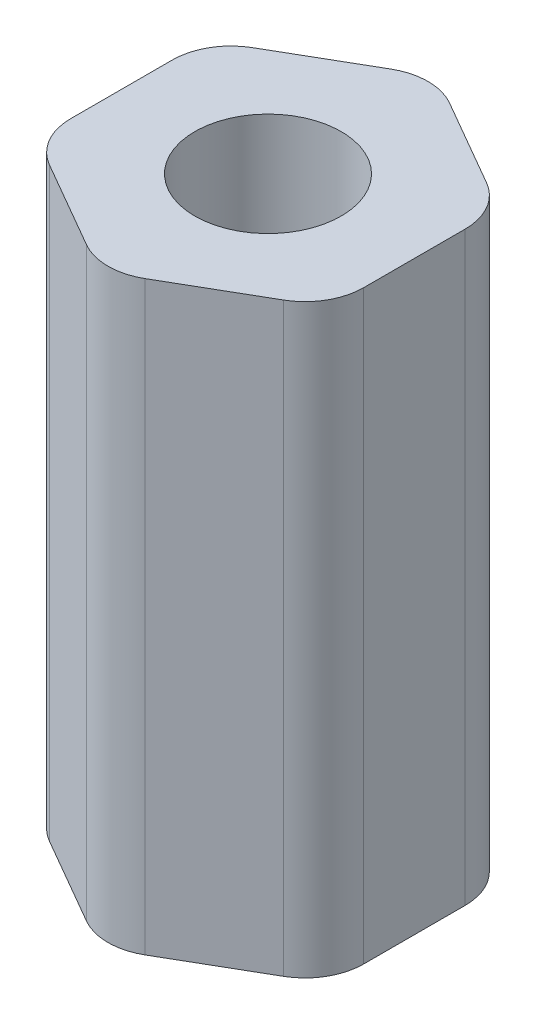
ISO-10303-21;
HEADER;
FILE_DESCRIPTION(('STEP AP214'),'2;1');
FILE_NAME('part.step','',(''),(''),'','','');
FILE_SCHEMA(('AUTOMOTIVE_DESIGN { 1 0 10303 214 1 1 1 1 }'));
ENDSEC;
DATA;
#1=APPLICATION_CONTEXT('core data for automotive mechanical design processes');
#2=APPLICATION_PROTOCOL_DEFINITION('international standard','automotive_design',2000,#1);
#3=PRODUCT_CONTEXT('',#1,'mechanical');
#4=PRODUCT('Part','Part','',(#3));
#5=PRODUCT_RELATED_PRODUCT_CATEGORY('part','',(#4));
#6=PRODUCT_DEFINITION_FORMATION('','',#4);
#7=PRODUCT_DEFINITION_CONTEXT('part definition',#1,'design');
#8=PRODUCT_DEFINITION('design','',#6,#7);
#9=PRODUCT_DEFINITION_SHAPE('','',#8);
#10=(LENGTH_UNIT() NAMED_UNIT(*) SI_UNIT(.MILLI.,.METRE.));
#11=(NAMED_UNIT(*) PLANE_ANGLE_UNIT() SI_UNIT($,.RADIAN.));
#12=(NAMED_UNIT(*) SI_UNIT($,.STERADIAN.) SOLID_ANGLE_UNIT());
#13=UNCERTAINTY_MEASURE_WITH_UNIT(LENGTH_MEASURE(1.E-05),#10,'distance_accuracy_value','');
#14=(GEOMETRIC_REPRESENTATION_CONTEXT(3) GLOBAL_UNCERTAINTY_ASSIGNED_CONTEXT((#13)) GLOBAL_UNIT_ASSIGNED_CONTEXT((#10,
#11,#12)) REPRESENTATION_CONTEXT('',''));
#15=CARTESIAN_POINT('',(0.,0.,0.));
#16=DIRECTION('',(0.,0.,1.));
#17=DIRECTION('',(1.,0.,0.));
#18=AXIS2_PLACEMENT_3D('',#15,#16,#17);
#19=CARTESIAN_POINT('',(0.,25.4,0.));
#20=DIRECTION('',(0.,1.,0.));
#21=DIRECTION('',(0.,0.,1.));
#22=AXIS2_PLACEMENT_3D('',#19,#20,#21);
#23=PLANE('',#22);
#24=DIRECTION('',(0.,0.,1.));
#25=VECTOR('',#24,1.);
#26=CARTESIAN_POINT('',(-6.35,25.4,-3.66617420935413));
#27=LINE('',#26,#25);
#28=CARTESIAN_POINT('',(-6.35,25.4,-2.19970452561248));
#29=VERTEX_POINT('',#28);
#30=CARTESIAN_POINT('',(-6.35,25.4,2.19970452561247));
#31=VERTEX_POINT('',#30);
#32=EDGE_CURVE('E230',#29,#31,#27,.T.);
#33=ORIENTED_EDGE('',*,*,#32,.T.);
#34=CARTESIAN_POINT('',(-3.81,25.4,2.19970452561248));
#35=DIRECTION('',(0.,1.,0.));
#36=DIRECTION('',(0.,0.,1.));
#37=AXIS2_PLACEMENT_3D('',#34,#35,#36);
#38=CIRCLE('',#37,2.54);
#39=CARTESIAN_POINT('',(-5.08,25.4,4.39940905122495));
#40=VERTEX_POINT('',#39);
#41=EDGE_CURVE('E181',#31,#40,#38,.T.);
#42=ORIENTED_EDGE('',*,*,#41,.T.);
#43=DIRECTION('',(0.866025403784438,0.,0.5));
#44=VECTOR('',#43,1.);
#45=CARTESIAN_POINT('',(-6.35,25.4,3.66617420935412));
#46=LINE('',#45,#44);
#47=CARTESIAN_POINT('',(-1.27,25.4,6.59911357683743));
#48=VERTEX_POINT('',#47);
#49=EDGE_CURVE('E143',#40,#48,#46,.T.);
#50=ORIENTED_EDGE('',*,*,#49,.T.);
#51=CARTESIAN_POINT('',(0.,25.4,4.39940905122495));
#52=DIRECTION('',(0.,1.,0.));
#53=DIRECTION('',(0.,0.,1.));
#54=AXIS2_PLACEMENT_3D('',#51,#52,#53);
#55=CIRCLE('',#54,2.54);
#56=CARTESIAN_POINT('',(1.27,25.4,6.59911357683743));
#57=VERTEX_POINT('',#56);
#58=EDGE_CURVE('E172',#48,#57,#55,.T.);
#59=ORIENTED_EDGE('',*,*,#58,.T.);
#60=DIRECTION('',(0.866025403784439,0.,-0.5));
#61=VECTOR('',#60,1.);
#62=CARTESIAN_POINT('',(0.,25.4,7.33234841870825));
#63=LINE('',#62,#61);
#64=CARTESIAN_POINT('',(5.08,25.4,4.39940905122495));
#65=VERTEX_POINT('',#64);
#66=EDGE_CURVE('E150',#57,#65,#63,.T.);
#67=ORIENTED_EDGE('',*,*,#66,.T.);
#68=CARTESIAN_POINT('',(3.81,25.4,2.19970452561248));
#69=DIRECTION('',(0.,1.,0.));
#70=DIRECTION('',(0.,0.,1.));
#71=AXIS2_PLACEMENT_3D('',#68,#69,#70);
#72=CIRCLE('',#71,2.54);
#73=CARTESIAN_POINT('',(6.35,25.4,2.19970452561248));
#74=VERTEX_POINT('',#73);
#75=EDGE_CURVE('E174',#65,#74,#72,.T.);
#76=ORIENTED_EDGE('',*,*,#75,.T.);
#77=DIRECTION('',(0.,0.,-1.));
#78=VECTOR('',#77,1.);
#79=CARTESIAN_POINT('',(6.35,25.4,3.66617420935413));
#80=LINE('',#79,#78);
#81=CARTESIAN_POINT('',(6.35,25.4,-2.19970452561248));
#82=VERTEX_POINT('',#81);
#83=EDGE_CURVE('E154',#74,#82,#80,.T.);
#84=ORIENTED_EDGE('',*,*,#83,.T.);
#85=CARTESIAN_POINT('',(3.81,25.4,-2.19970452561248));
#86=DIRECTION('',(0.,1.,0.));
#87=DIRECTION('',(0.,0.,1.));
#88=AXIS2_PLACEMENT_3D('',#85,#86,#87);
#89=CIRCLE('',#88,2.54);
#90=CARTESIAN_POINT('',(5.08,25.4,-4.39940905122495));
#91=VERTEX_POINT('',#90);
#92=EDGE_CURVE('E176',#82,#91,#89,.T.);
#93=ORIENTED_EDGE('',*,*,#92,.T.);
#94=DIRECTION('',(-0.866025403784438,0.,-0.5));
#95=VECTOR('',#94,1.);
#96=CARTESIAN_POINT('',(6.35,25.4,-3.66617420935413));
#97=LINE('',#96,#95);
#98=CARTESIAN_POINT('',(1.27,25.4,-6.59911357683743));
#99=VERTEX_POINT('',#98);
#100=EDGE_CURVE('E234',#91,#99,#97,.T.);
#101=ORIENTED_EDGE('',*,*,#100,.T.);
#102=CARTESIAN_POINT('',(0.,25.4,-4.39940905122495));
#103=DIRECTION('',(0.,1.,0.));
#104=DIRECTION('',(0.,0.,1.));
#105=AXIS2_PLACEMENT_3D('',#102,#103,#104);
#106=CIRCLE('',#105,2.54);
#107=CARTESIAN_POINT('',(-1.27,25.4,-6.59911357683743));
#108=VERTEX_POINT('',#107);
#109=EDGE_CURVE('E55',#99,#108,#106,.T.);
#110=ORIENTED_EDGE('',*,*,#109,.T.);
#111=DIRECTION('',(-0.866025403784439,0.,0.5));
#112=VECTOR('',#111,1.);
#113=CARTESIAN_POINT('',(0.,25.4,-7.33234841870825));
#114=LINE('',#113,#112);
#115=CARTESIAN_POINT('',(-5.08,25.4,-4.39940905122495));
#116=VERTEX_POINT('',#115);
#117=EDGE_CURVE('E231',#108,#116,#114,.T.);
#118=ORIENTED_EDGE('',*,*,#117,.T.);
#119=CARTESIAN_POINT('',(-3.81,25.4,-2.19970452561248));
#120=DIRECTION('',(0.,1.,0.));
#121=DIRECTION('',(0.,0.,1.));
#122=AXIS2_PLACEMENT_3D('',#119,#120,#121);
#123=CIRCLE('',#122,2.54);
#124=EDGE_CURVE('E179',#116,#29,#123,.T.);
#125=ORIENTED_EDGE('',*,*,#124,.T.);
#126=EDGE_LOOP('',(#33,#42,#50,#59,#67,#76,#84,#93,#101,#110,#118,#125));
#127=FACE_BOUND('',#126,.T.);
#128=CARTESIAN_POINT('',(0.,25.4,0.));
#129=DIRECTION('',(0.,1.,0.));
#130=DIRECTION('',(0.,0.,1.));
#131=AXIS2_PLACEMENT_3D('',#128,#129,#130);
#132=CIRCLE('',#131,3.175);
#133=CARTESIAN_POINT('',(0.,25.4,3.175));
#134=VERTEX_POINT('',#133);
#135=EDGE_CURVE('E208',#134,#134,#132,.T.);
#136=ORIENTED_EDGE('',*,*,#135,.F.);
#137=EDGE_LOOP('',(#136));
#138=FACE_BOUND('',#137,.T.);
#139=ADVANCED_FACE('F33',(#127,#138),#23,.T.);
#140=CARTESIAN_POINT('',(0.,0.,0.));
#141=DIRECTION('',(0.,1.,0.));
#142=DIRECTION('',(0.,0.,1.));
#143=AXIS2_PLACEMENT_3D('',#140,#141,#142);
#144=PLANE('',#143);
#145=DIRECTION('',(0.866025403784438,0.,0.5));
#146=VECTOR('',#145,1.);
#147=CARTESIAN_POINT('',(-6.35,0.,3.66617420935412));
#148=LINE('',#147,#146);
#149=CARTESIAN_POINT('',(-5.08,0.,4.39940905122495));
#150=VERTEX_POINT('',#149);
#151=CARTESIAN_POINT('',(-1.27,0.,6.59911357683743));
#152=VERTEX_POINT('',#151);
#153=EDGE_CURVE('E140',#150,#152,#148,.T.);
#154=ORIENTED_EDGE('',*,*,#153,.F.);
#155=CARTESIAN_POINT('',(-3.81,0.,2.19970452561248));
#156=DIRECTION('',(0.,1.,0.));
#157=DIRECTION('',(0.,0.,1.));
#158=AXIS2_PLACEMENT_3D('',#155,#156,#157);
#159=CIRCLE('',#158,2.54);
#160=CARTESIAN_POINT('',(-6.35,0.,2.19970452561247));
#161=VERTEX_POINT('',#160);
#162=EDGE_CURVE('E123',#150,#161,#159,.F.);
#163=ORIENTED_EDGE('',*,*,#162,.T.);
#164=DIRECTION('',(0.,0.,1.));
#165=VECTOR('',#164,1.);
#166=CARTESIAN_POINT('',(-6.35,0.,-3.66617420935413));
#167=LINE('',#166,#165);
#168=CARTESIAN_POINT('',(-6.35,0.,-2.19970452561248));
#169=VERTEX_POINT('',#168);
#170=EDGE_CURVE('E151',#169,#161,#167,.T.);
#171=ORIENTED_EDGE('',*,*,#170,.F.);
#172=CARTESIAN_POINT('',(-3.81,0.,-2.19970452561248));
#173=DIRECTION('',(0.,1.,0.));
#174=DIRECTION('',(0.,0.,1.));
#175=AXIS2_PLACEMENT_3D('',#172,#173,#174);
#176=CIRCLE('',#175,2.54);
#177=CARTESIAN_POINT('',(-5.08,0.,-4.39940905122495));
#178=VERTEX_POINT('',#177);
#179=EDGE_CURVE('E134',#169,#178,#176,.F.);
#180=ORIENTED_EDGE('',*,*,#179,.T.);
#181=DIRECTION('',(-0.866025403784439,0.,0.5));
#182=VECTOR('',#181,1.);
#183=CARTESIAN_POINT('',(0.,0.,-7.33234841870825));
#184=LINE('',#183,#182);
#185=CARTESIAN_POINT('',(-1.27,0.,-6.59911357683743));
#186=VERTEX_POINT('',#185);
#187=EDGE_CURVE('E156',#186,#178,#184,.T.);
#188=ORIENTED_EDGE('',*,*,#187,.F.);
#189=CARTESIAN_POINT('',(0.,0.,-4.39940905122495));
#190=DIRECTION('',(0.,1.,0.));
#191=DIRECTION('',(0.,0.,1.));
#192=AXIS2_PLACEMENT_3D('',#189,#190,#191);
#193=CIRCLE('',#192,2.54);
#194=CARTESIAN_POINT('',(1.27,0.,-6.59911357683743));
#195=VERTEX_POINT('',#194);
#196=EDGE_CURVE('E166',#186,#195,#193,.F.);
#197=ORIENTED_EDGE('',*,*,#196,.T.);
#198=DIRECTION('',(-0.866025403784438,0.,-0.5));
#199=VECTOR('',#198,1.);
#200=CARTESIAN_POINT('',(6.35,0.,-3.66617420935413));
#201=LINE('',#200,#199);
#202=CARTESIAN_POINT('',(5.08,0.,-4.39940905122495));
#203=VERTEX_POINT('',#202);
#204=EDGE_CURVE('E211',#203,#195,#201,.T.);
#205=ORIENTED_EDGE('',*,*,#204,.F.);
#206=CARTESIAN_POINT('',(3.81,0.,-2.19970452561248));
#207=DIRECTION('',(0.,1.,0.));
#208=DIRECTION('',(0.,0.,1.));
#209=AXIS2_PLACEMENT_3D('',#206,#207,#208);
#210=CIRCLE('',#209,2.54);
#211=CARTESIAN_POINT('',(6.35,0.,-2.19970452561248));
#212=VERTEX_POINT('',#211);
#213=EDGE_CURVE('E164',#203,#212,#210,.F.);
#214=ORIENTED_EDGE('',*,*,#213,.T.);
#215=DIRECTION('',(0.,0.,-1.));
#216=VECTOR('',#215,1.);
#217=CARTESIAN_POINT('',(6.35,0.,3.66617420935413));
#218=LINE('',#217,#216);
#219=CARTESIAN_POINT('',(6.35,0.,2.19970452561248));
#220=VERTEX_POINT('',#219);
#221=EDGE_CURVE('E207',#220,#212,#218,.T.);
#222=ORIENTED_EDGE('',*,*,#221,.F.);
#223=CARTESIAN_POINT('',(3.81,0.,2.19970452561248));
#224=DIRECTION('',(0.,1.,0.));
#225=DIRECTION('',(0.,0.,1.));
#226=AXIS2_PLACEMENT_3D('',#223,#224,#225);
#227=CIRCLE('',#226,2.54);
#228=CARTESIAN_POINT('',(5.08,0.,4.39940905122495));
#229=VERTEX_POINT('',#228);
#230=EDGE_CURVE('E162',#220,#229,#227,.F.);
#231=ORIENTED_EDGE('',*,*,#230,.T.);
#232=DIRECTION('',(0.866025403784439,0.,-0.5));
#233=VECTOR('',#232,1.);
#234=CARTESIAN_POINT('',(0.,0.,7.33234841870825));
#235=LINE('',#234,#233);
#236=CARTESIAN_POINT('',(1.27,0.,6.59911357683743));
#237=VERTEX_POINT('',#236);
#238=EDGE_CURVE('E202',#237,#229,#235,.T.);
#239=ORIENTED_EDGE('',*,*,#238,.F.);
#240=CARTESIAN_POINT('',(0.,0.,4.39940905122495));
#241=DIRECTION('',(0.,1.,0.));
#242=DIRECTION('',(0.,0.,1.));
#243=AXIS2_PLACEMENT_3D('',#240,#241,#242);
#244=CIRCLE('',#243,2.54);
#245=EDGE_CURVE('E144',#237,#152,#244,.F.);
#246=ORIENTED_EDGE('',*,*,#245,.T.);
#247=EDGE_LOOP('',(#154,#163,#171,#180,#188,#197,#205,#214,#222,#231,#239,#246));
#248=FACE_BOUND('',#247,.T.);
#249=CARTESIAN_POINT('',(0.,0.,0.));
#250=DIRECTION('',(0.,1.,0.));
#251=DIRECTION('',(0.,0.,1.));
#252=AXIS2_PLACEMENT_3D('',#249,#250,#251);
#253=CIRCLE('',#252,3.175);
#254=CARTESIAN_POINT('',(0.,0.,3.175));
#255=VERTEX_POINT('',#254);
#256=EDGE_CURVE('E214',#255,#255,#253,.T.);
#257=ORIENTED_EDGE('',*,*,#256,.T.);
#258=EDGE_LOOP('',(#257));
#259=FACE_BOUND('',#258,.T.);
#260=ADVANCED_FACE('F147',(#248,#259),#144,.F.);
#261=CARTESIAN_POINT('',(0.,25.4,7.33234841870825));
#262=DIRECTION('',(-0.5,0.,-0.866025403784439));
#263=DIRECTION('',(-0.866025403784439,0.,0.5));
#264=AXIS2_PLACEMENT_3D('',#261,#262,#263);
#265=PLANE('',#264);
#266=ORIENTED_EDGE('',*,*,#238,.T.);
#267=DIRECTION('',(0.,-1.,0.));
#268=VECTOR('',#267,1.);
#269=CARTESIAN_POINT('',(5.08,25.4,4.39940905122495));
#270=LINE('',#269,#268);
#271=EDGE_CURVE('E11',#229,#65,#270,.F.);
#272=ORIENTED_EDGE('',*,*,#271,.T.);
#273=ORIENTED_EDGE('',*,*,#66,.F.);
#274=DIRECTION('',(0.,-1.,0.));
#275=VECTOR('',#274,1.);
#276=CARTESIAN_POINT('',(1.27,25.4,6.59911357683743));
#277=LINE('',#276,#275);
#278=EDGE_CURVE('E41',#57,#237,#277,.T.);
#279=ORIENTED_EDGE('',*,*,#278,.T.);
#280=EDGE_LOOP('',(#266,#272,#273,#279));
#281=FACE_BOUND('',#280,.T.);
#282=ADVANCED_FACE('F201',(#281),#265,.F.);
#283=CARTESIAN_POINT('',(6.35,25.4,3.66617420935413));
#284=DIRECTION('',(-1.,0.,0.));
#285=DIRECTION('',(0.,0.,1.));
#286=AXIS2_PLACEMENT_3D('',#283,#284,#285);
#287=PLANE('',#286);
#288=ORIENTED_EDGE('',*,*,#221,.T.);
#289=DIRECTION('',(0.,-1.,0.));
#290=VECTOR('',#289,1.);
#291=CARTESIAN_POINT('',(6.35,25.4,-2.19970452561248));
#292=LINE('',#291,#290);
#293=EDGE_CURVE('E195',#212,#82,#292,.F.);
#294=ORIENTED_EDGE('',*,*,#293,.T.);
#295=ORIENTED_EDGE('',*,*,#83,.F.);
#296=DIRECTION('',(0.,-1.,0.));
#297=VECTOR('',#296,1.);
#298=CARTESIAN_POINT('',(6.35,25.4,2.19970452561248));
#299=LINE('',#298,#297);
#300=EDGE_CURVE('E192',#74,#220,#299,.T.);
#301=ORIENTED_EDGE('',*,*,#300,.T.);
#302=EDGE_LOOP('',(#288,#294,#295,#301));
#303=FACE_BOUND('',#302,.T.);
#304=ADVANCED_FACE('F267',(#303),#287,.F.);
#305=CARTESIAN_POINT('',(6.35,25.4,-3.66617420935413));
#306=DIRECTION('',(-0.5,0.,0.866025403784438));
#307=DIRECTION('',(0.866025403784439,0.,0.5));
#308=AXIS2_PLACEMENT_3D('',#305,#306,#307);
#309=PLANE('',#308);
#310=ORIENTED_EDGE('',*,*,#204,.T.);
#311=DIRECTION('',(0.,-1.,0.));
#312=VECTOR('',#311,1.);
#313=CARTESIAN_POINT('',(1.27,25.4,-6.59911357683743));
#314=LINE('',#313,#312);
#315=EDGE_CURVE('E190',#195,#99,#314,.F.);
#316=ORIENTED_EDGE('',*,*,#315,.T.);
#317=ORIENTED_EDGE('',*,*,#100,.F.);
#318=DIRECTION('',(0.,-1.,0.));
#319=VECTOR('',#318,1.);
#320=CARTESIAN_POINT('',(5.08,25.4,-4.39940905122495));
#321=LINE('',#320,#319);
#322=EDGE_CURVE('E187',#91,#203,#321,.T.);
#323=ORIENTED_EDGE('',*,*,#322,.T.);
#324=EDGE_LOOP('',(#310,#316,#317,#323));
#325=FACE_BOUND('',#324,.T.);
#326=ADVANCED_FACE('F264',(#325),#309,.F.);
#327=CARTESIAN_POINT('',(0.,25.4,-7.33234841870825));
#328=DIRECTION('',(0.5,0.,0.866025403784439));
#329=DIRECTION('',(0.866025403784439,0.,-0.5));
#330=AXIS2_PLACEMENT_3D('',#327,#328,#329);
#331=PLANE('',#330);
#332=ORIENTED_EDGE('',*,*,#187,.T.);
#333=DIRECTION('',(0.,-1.,0.));
#334=VECTOR('',#333,1.);
#335=CARTESIAN_POINT('',(-5.08,25.4,-4.39940905122495));
#336=LINE('',#335,#334);
#337=EDGE_CURVE('E48',#178,#116,#336,.F.);
#338=ORIENTED_EDGE('',*,*,#337,.T.);
#339=ORIENTED_EDGE('',*,*,#117,.F.);
#340=DIRECTION('',(0.,-1.,0.));
#341=VECTOR('',#340,1.);
#342=CARTESIAN_POINT('',(-1.27,25.4,-6.59911357683743));
#343=LINE('',#342,#341);
#344=EDGE_CURVE('E183',#108,#186,#343,.T.);
#345=ORIENTED_EDGE('',*,*,#344,.T.);
#346=EDGE_LOOP('',(#332,#338,#339,#345));
#347=FACE_BOUND('',#346,.T.);
#348=ADVANCED_FACE('F221',(#347),#331,.F.);
#349=CARTESIAN_POINT('',(-6.35,25.4,-3.66617420935413));
#350=DIRECTION('',(1.,0.,0.));
#351=DIRECTION('',(0.,0.,-1.));
#352=AXIS2_PLACEMENT_3D('',#349,#350,#351);
#353=PLANE('',#352);
#354=ORIENTED_EDGE('',*,*,#170,.T.);
#355=DIRECTION('',(0.,-1.,0.));
#356=VECTOR('',#355,1.);
#357=CARTESIAN_POINT('',(-6.35,25.4,2.19970452561248));
#358=LINE('',#357,#356);
#359=EDGE_CURVE('E128',#161,#31,#358,.F.);
#360=ORIENTED_EDGE('',*,*,#359,.T.);
#361=ORIENTED_EDGE('',*,*,#32,.F.);
#362=DIRECTION('',(0.,-1.,0.));
#363=VECTOR('',#362,1.);
#364=CARTESIAN_POINT('',(-6.35,25.4,-2.19970452561248));
#365=LINE('',#364,#363);
#366=EDGE_CURVE('E133',#29,#169,#365,.T.);
#367=ORIENTED_EDGE('',*,*,#366,.T.);
#368=EDGE_LOOP('',(#354,#360,#361,#367));
#369=FACE_BOUND('',#368,.T.);
#370=ADVANCED_FACE('F233',(#369),#353,.F.);
#371=CARTESIAN_POINT('',(-6.35,25.4,3.66617420935412));
#372=DIRECTION('',(0.5,0.,-0.866025403784438));
#373=DIRECTION('',(-0.866025403784439,0.,-0.5));
#374=AXIS2_PLACEMENT_3D('',#371,#372,#373);
#375=PLANE('',#374);
#376=ORIENTED_EDGE('',*,*,#49,.F.);
#377=DIRECTION('',(0.,-1.,0.));
#378=VECTOR('',#377,1.);
#379=CARTESIAN_POINT('',(-5.08,25.4,4.39940905122495));
#380=LINE('',#379,#378);
#381=EDGE_CURVE('E127',#40,#150,#380,.T.);
#382=ORIENTED_EDGE('',*,*,#381,.T.);
#383=ORIENTED_EDGE('',*,*,#153,.T.);
#384=DIRECTION('',(0.,-1.,0.));
#385=VECTOR('',#384,1.);
#386=CARTESIAN_POINT('',(-1.27,25.4,6.59911357683743));
#387=LINE('',#386,#385);
#388=EDGE_CURVE('E145',#152,#48,#387,.F.);
#389=ORIENTED_EDGE('',*,*,#388,.T.);
#390=EDGE_LOOP('',(#376,#382,#383,#389));
#391=FACE_BOUND('',#390,.T.);
#392=ADVANCED_FACE('F139',(#391),#375,.F.);
#393=CARTESIAN_POINT('',(0.,25.4,0.));
#394=DIRECTION('',(0.,-1.,0.));
#395=DIRECTION('',(0.,0.,-1.));
#396=AXIS2_PLACEMENT_3D('',#393,#394,#395);
#397=CYLINDRICAL_SURFACE('',#396,3.175);
#398=ORIENTED_EDGE('',*,*,#135,.T.);
#399=EDGE_LOOP('',(#398));
#400=FACE_BOUND('',#399,.T.);
#401=ORIENTED_EDGE('',*,*,#256,.F.);
#402=EDGE_LOOP('',(#401));
#403=FACE_BOUND('',#402,.T.);
#404=ADVANCED_FACE('F243',(#400,#403),#397,.F.);
#405=CARTESIAN_POINT('',(-3.81,25.4,2.19970452561248));
#406=DIRECTION('',(0.,-1.,0.));
#407=DIRECTION('',(0.,0.,-1.));
#408=AXIS2_PLACEMENT_3D('',#405,#406,#407);
#409=CYLINDRICAL_SURFACE('',#408,2.54);
#410=ORIENTED_EDGE('',*,*,#41,.F.);
#411=ORIENTED_EDGE('',*,*,#359,.F.);
#412=ORIENTED_EDGE('',*,*,#162,.F.);
#413=ORIENTED_EDGE('',*,*,#381,.F.);
#414=EDGE_LOOP('',(#410,#411,#412,#413));
#415=FACE_BOUND('',#414,.T.);
#416=ADVANCED_FACE('F126',(#415),#409,.T.);
#417=CARTESIAN_POINT('',(-3.81,25.4,-2.19970452561248));
#418=DIRECTION('',(0.,-1.,0.));
#419=DIRECTION('',(0.,0.,-1.));
#420=AXIS2_PLACEMENT_3D('',#417,#418,#419);
#421=CYLINDRICAL_SURFACE('',#420,2.54);
#422=ORIENTED_EDGE('',*,*,#124,.F.);
#423=ORIENTED_EDGE('',*,*,#337,.F.);
#424=ORIENTED_EDGE('',*,*,#179,.F.);
#425=ORIENTED_EDGE('',*,*,#366,.F.);
#426=EDGE_LOOP('',(#422,#423,#424,#425));
#427=FACE_BOUND('',#426,.T.);
#428=ADVANCED_FACE('F225',(#427),#421,.T.);
#429=CARTESIAN_POINT('',(0.,25.4,-4.39940905122495));
#430=DIRECTION('',(0.,-1.,0.));
#431=DIRECTION('',(0.,0.,-1.));
#432=AXIS2_PLACEMENT_3D('',#429,#430,#431);
#433=CYLINDRICAL_SURFACE('',#432,2.54);
#434=ORIENTED_EDGE('',*,*,#109,.F.);
#435=ORIENTED_EDGE('',*,*,#315,.F.);
#436=ORIENTED_EDGE('',*,*,#196,.F.);
#437=ORIENTED_EDGE('',*,*,#344,.F.);
#438=EDGE_LOOP('',(#434,#435,#436,#437));
#439=FACE_BOUND('',#438,.T.);
#440=ADVANCED_FACE('F276',(#439),#433,.T.);
#441=CARTESIAN_POINT('',(3.81,25.4,-2.19970452561248));
#442=DIRECTION('',(0.,-1.,0.));
#443=DIRECTION('',(0.,0.,-1.));
#444=AXIS2_PLACEMENT_3D('',#441,#442,#443);
#445=CYLINDRICAL_SURFACE('',#444,2.54);
#446=ORIENTED_EDGE('',*,*,#92,.F.);
#447=ORIENTED_EDGE('',*,*,#293,.F.);
#448=ORIENTED_EDGE('',*,*,#213,.F.);
#449=ORIENTED_EDGE('',*,*,#322,.F.);
#450=EDGE_LOOP('',(#446,#447,#448,#449));
#451=FACE_BOUND('',#450,.T.);
#452=ADVANCED_FACE('F279',(#451),#445,.T.);
#453=CARTESIAN_POINT('',(3.81,25.4,2.19970452561248));
#454=DIRECTION('',(0.,-1.,0.));
#455=DIRECTION('',(0.,0.,-1.));
#456=AXIS2_PLACEMENT_3D('',#453,#454,#455);
#457=CYLINDRICAL_SURFACE('',#456,2.54);
#458=ORIENTED_EDGE('',*,*,#75,.F.);
#459=ORIENTED_EDGE('',*,*,#271,.F.);
#460=ORIENTED_EDGE('',*,*,#230,.F.);
#461=ORIENTED_EDGE('',*,*,#300,.F.);
#462=EDGE_LOOP('',(#458,#459,#460,#461));
#463=FACE_BOUND('',#462,.T.);
#464=ADVANCED_FACE('F282',(#463),#457,.T.);
#465=CARTESIAN_POINT('',(0.,25.4,4.39940905122495));
#466=DIRECTION('',(0.,-1.,0.));
#467=DIRECTION('',(0.,0.,-1.));
#468=AXIS2_PLACEMENT_3D('',#465,#466,#467);
#469=CYLINDRICAL_SURFACE('',#468,2.54);
#470=ORIENTED_EDGE('',*,*,#58,.F.);
#471=ORIENTED_EDGE('',*,*,#388,.F.);
#472=ORIENTED_EDGE('',*,*,#245,.F.);
#473=ORIENTED_EDGE('',*,*,#278,.F.);
#474=EDGE_LOOP('',(#470,#471,#472,#473));
#475=FACE_BOUND('',#474,.T.);
#476=ADVANCED_FACE('F35',(#475),#469,.T.);
#477=CLOSED_SHELL('',(#139,#260,#282,#304,#326,#348,#370,#392,#404,#416,#428,#440,#452,#464,#476));
#478=MANIFOLD_SOLID_BREP('B2',#477);
#479=ADVANCED_BREP_SHAPE_REPRESENTATION('',(#18,#478),#14);
#480=SHAPE_DEFINITION_REPRESENTATION(#9,#479);
ENDSEC;
END-ISO-10303-21;
